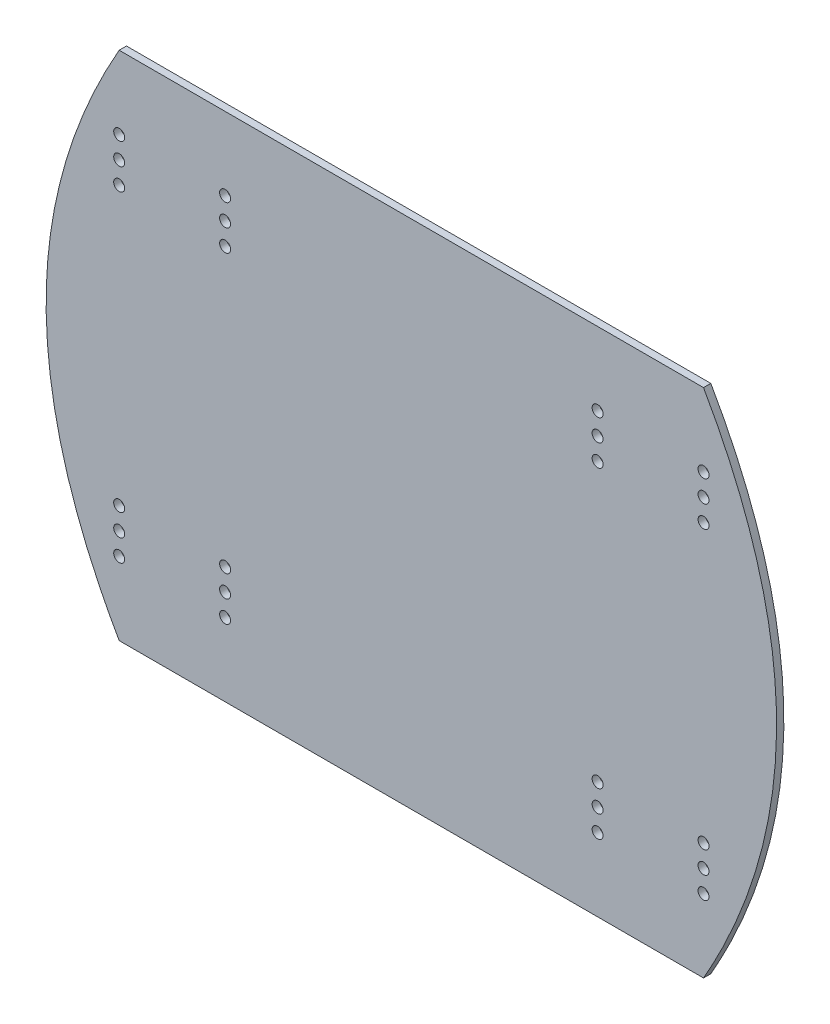
ISO-10303-21;
HEADER;
FILE_DESCRIPTION(('STEP AP214'),'2;1');
FILE_NAME('part.step','',(''),(''),'','','');
FILE_SCHEMA(('AUTOMOTIVE_DESIGN { 1 0 10303 214 1 1 1 1 }'));
ENDSEC;
DATA;
#1=APPLICATION_CONTEXT('core data for automotive mechanical design processes');
#2=APPLICATION_PROTOCOL_DEFINITION('international standard','automotive_design',2000,#1);
#3=PRODUCT_CONTEXT('',#1,'mechanical');
#4=PRODUCT('Part','Part','',(#3));
#5=PRODUCT_RELATED_PRODUCT_CATEGORY('part','',(#4));
#6=PRODUCT_DEFINITION_FORMATION('','',#4);
#7=PRODUCT_DEFINITION_CONTEXT('part definition',#1,'design');
#8=PRODUCT_DEFINITION('design','',#6,#7);
#9=PRODUCT_DEFINITION_SHAPE('','',#8);
#10=(LENGTH_UNIT() NAMED_UNIT(*) SI_UNIT(.MILLI.,.METRE.));
#11=(NAMED_UNIT(*) PLANE_ANGLE_UNIT() SI_UNIT($,.RADIAN.));
#12=(NAMED_UNIT(*) SI_UNIT($,.STERADIAN.) SOLID_ANGLE_UNIT());
#13=UNCERTAINTY_MEASURE_WITH_UNIT(LENGTH_MEASURE(1.E-05),#10,'distance_accuracy_value','');
#14=(GEOMETRIC_REPRESENTATION_CONTEXT(3) GLOBAL_UNCERTAINTY_ASSIGNED_CONTEXT((#13)) GLOBAL_UNIT_ASSIGNED_CONTEXT((#10,
#11,#12)) REPRESENTATION_CONTEXT('',''));
#15=CARTESIAN_POINT('',(0.,0.,0.));
#16=DIRECTION('',(0.,0.,1.));
#17=DIRECTION('',(1.,0.,0.));
#18=AXIS2_PLACEMENT_3D('',#15,#16,#17);
#19=CARTESIAN_POINT('',(80.,70.,307.174130620536));
#20=CARTESIAN_POINT('',(120.,0.,307.174130620536));
#21=CARTESIAN_POINT('',(79.9999999999999,-70.,307.174130620536));
#22=B_SPLINE_CURVE_WITH_KNOTS('',2,(#19,#20,#21),.UNSPECIFIED.,.F.,.F.,(3,3),(0.,1.),.UNSPECIFIED.);
#23=DIRECTION('',(0.,0.,-1.));
#24=VECTOR('',#23,1.);
#25=SURFACE_OF_LINEAR_EXTRUSION('',#22,#24);
#26=DIRECTION('',(0.,0.,-1.));
#27=VECTOR('',#26,1.);
#28=CARTESIAN_POINT('',(80.,70.,307.174130620536));
#29=LINE('',#28,#27);
#30=CARTESIAN_POINT('',(80.,70.,2.));
#31=VERTEX_POINT('',#30);
#32=CARTESIAN_POINT('',(80.,70.,0.));
#33=VERTEX_POINT('',#32);
#34=EDGE_CURVE('E92',#31,#33,#29,.T.);
#35=ORIENTED_EDGE('',*,*,#34,.F.);
#36=CARTESIAN_POINT('',(80.,70.,2.));
#37=CARTESIAN_POINT('',(120.,0.,2.));
#38=CARTESIAN_POINT('',(79.9999999999999,-70.,2.));
#39=B_SPLINE_CURVE_WITH_KNOTS('',2,(#36,#37,#38),.UNSPECIFIED.,.F.,.F.,(3,3),(0.,1.),.UNSPECIFIED.);
#40=CARTESIAN_POINT('',(79.9999999999999,-70.,2.));
#41=VERTEX_POINT('',#40);
#42=EDGE_CURVE('E54',#41,#31,#39,.F.);
#43=ORIENTED_EDGE('',*,*,#42,.F.);
#44=DIRECTION('',(0.,0.,-1.));
#45=VECTOR('',#44,1.);
#46=CARTESIAN_POINT('',(79.9999999999999,-70.,307.174130620536));
#47=LINE('',#46,#45);
#48=CARTESIAN_POINT('',(79.9999999999999,-70.,0.));
#49=VERTEX_POINT('',#48);
#50=EDGE_CURVE('E62',#41,#49,#47,.T.);
#51=ORIENTED_EDGE('',*,*,#50,.T.);
#52=CARTESIAN_POINT('',(80.,70.,0.));
#53=CARTESIAN_POINT('',(120.,0.,0.));
#54=CARTESIAN_POINT('',(79.9999999999999,-70.,0.));
#55=B_SPLINE_CURVE_WITH_KNOTS('',2,(#52,#53,#54),.UNSPECIFIED.,.F.,.F.,(3,3),(0.,1.),.UNSPECIFIED.);
#56=EDGE_CURVE('E11',#49,#33,#55,.F.);
#57=ORIENTED_EDGE('',*,*,#56,.T.);
#58=EDGE_LOOP('',(#35,#43,#51,#57));
#59=FACE_BOUND('',#58,.T.);
#60=ADVANCED_FACE('F37',(#59),#25,.T.);
#61=CARTESIAN_POINT('',(100.,-70.,2.));
#62=DIRECTION('',(0.,1.,0.));
#63=DIRECTION('',(-1.,0.,0.));
#64=AXIS2_PLACEMENT_3D('',#61,#62,#63);
#65=PLANE('',#64);
#66=ORIENTED_EDGE('',*,*,#50,.F.);
#67=DIRECTION('',(1.,0.,0.));
#68=VECTOR('',#67,1.);
#69=CARTESIAN_POINT('',(100.,-70.,2.));
#70=LINE('',#69,#68);
#71=CARTESIAN_POINT('',(-80.,-70.,2.));
#72=VERTEX_POINT('',#71);
#73=EDGE_CURVE('E88',#72,#41,#70,.T.);
#74=ORIENTED_EDGE('',*,*,#73,.F.);
#75=DIRECTION('',(0.,0.,-1.));
#76=VECTOR('',#75,1.);
#77=CARTESIAN_POINT('',(-80.,-70.,309.674130620536));
#78=LINE('',#77,#76);
#79=CARTESIAN_POINT('',(-80.,-70.,0.));
#80=VERTEX_POINT('',#79);
#81=EDGE_CURVE('E114',#72,#80,#78,.T.);
#82=ORIENTED_EDGE('',*,*,#81,.T.);
#83=DIRECTION('',(1.,0.,0.));
#84=VECTOR('',#83,1.);
#85=CARTESIAN_POINT('',(100.,-70.,0.));
#86=LINE('',#85,#84);
#87=EDGE_CURVE('E89',#80,#49,#86,.T.);
#88=ORIENTED_EDGE('',*,*,#87,.T.);
#89=EDGE_LOOP('',(#66,#74,#82,#88));
#90=FACE_BOUND('',#89,.T.);
#91=ADVANCED_FACE('F39',(#90),#65,.F.);
#92=CARTESIAN_POINT('',(0.,0.,2.));
#93=DIRECTION('',(0.,0.,1.));
#94=DIRECTION('',(1.,0.,0.));
#95=AXIS2_PLACEMENT_3D('',#92,#93,#94);
#96=PLANE('',#95);
#97=CARTESIAN_POINT('',(51.,50.0019196147698,2.));
#98=DIRECTION('',(0.,0.,1.));
#99=DIRECTION('',(1.,0.,0.));
#100=AXIS2_PLACEMENT_3D('',#97,#98,#99);
#101=CIRCLE('',#100,1.5);
#102=CARTESIAN_POINT('',(52.5,50.0019196147698,2.));
#103=VERTEX_POINT('',#102);
#104=EDGE_CURVE('E554',#103,#103,#101,.T.);
#105=ORIENTED_EDGE('',*,*,#104,.F.);
#106=EDGE_LOOP('',(#105));
#107=FACE_BOUND('',#106,.T.);
#108=CARTESIAN_POINT('',(51.,44.0019196147698,2.));
#109=DIRECTION('',(0.,0.,1.));
#110=DIRECTION('',(1.,0.,0.));
#111=AXIS2_PLACEMENT_3D('',#108,#109,#110);
#112=CIRCLE('',#111,1.5);
#113=CARTESIAN_POINT('',(52.5,44.0019196147698,2.));
#114=VERTEX_POINT('',#113);
#115=EDGE_CURVE('E558',#114,#114,#112,.T.);
#116=ORIENTED_EDGE('',*,*,#115,.F.);
#117=EDGE_LOOP('',(#116));
#118=FACE_BOUND('',#117,.T.);
#119=CARTESIAN_POINT('',(51.,38.0019196147698,2.));
#120=DIRECTION('',(0.,0.,1.));
#121=DIRECTION('',(1.,0.,0.));
#122=AXIS2_PLACEMENT_3D('',#119,#120,#121);
#123=CIRCLE('',#122,1.5);
#124=CARTESIAN_POINT('',(52.5,38.0019196147698,2.));
#125=VERTEX_POINT('',#124);
#126=EDGE_CURVE('E562',#125,#125,#123,.T.);
#127=ORIENTED_EDGE('',*,*,#126,.F.);
#128=EDGE_LOOP('',(#127));
#129=FACE_BOUND('',#128,.T.);
#130=CARTESIAN_POINT('',(51.,-38.,2.));
#131=DIRECTION('',(0.,0.,1.));
#132=DIRECTION('',(1.,0.,0.));
#133=AXIS2_PLACEMENT_3D('',#130,#131,#132);
#134=CIRCLE('',#133,1.5);
#135=CARTESIAN_POINT('',(52.5,-38.,2.));
#136=VERTEX_POINT('',#135);
#137=EDGE_CURVE('E537',#136,#136,#134,.T.);
#138=ORIENTED_EDGE('',*,*,#137,.F.);
#139=EDGE_LOOP('',(#138));
#140=FACE_BOUND('',#139,.T.);
#141=CARTESIAN_POINT('',(51.,-44.0000000000001,2.));
#142=DIRECTION('',(0.,0.,1.));
#143=DIRECTION('',(1.,0.,0.));
#144=AXIS2_PLACEMENT_3D('',#141,#142,#143);
#145=CIRCLE('',#144,1.5);
#146=CARTESIAN_POINT('',(52.5,-44.0000000000001,2.));
#147=VERTEX_POINT('',#146);
#148=EDGE_CURVE('E538',#147,#147,#145,.T.);
#149=ORIENTED_EDGE('',*,*,#148,.F.);
#150=EDGE_LOOP('',(#149));
#151=FACE_BOUND('',#150,.T.);
#152=CARTESIAN_POINT('',(51.,-50.0000000000001,2.));
#153=DIRECTION('',(0.,0.,1.));
#154=DIRECTION('',(1.,0.,0.));
#155=AXIS2_PLACEMENT_3D('',#152,#153,#154);
#156=CIRCLE('',#155,1.5);
#157=CARTESIAN_POINT('',(52.5,-50.0000000000001,2.));
#158=VERTEX_POINT('',#157);
#159=EDGE_CURVE('E542',#158,#158,#156,.T.);
#160=ORIENTED_EDGE('',*,*,#159,.F.);
#161=EDGE_LOOP('',(#160));
#162=FACE_BOUND('',#161,.T.);
#163=CARTESIAN_POINT('',(80.,-38.,2.));
#164=DIRECTION('',(0.,0.,1.));
#165=DIRECTION('',(1.,0.,0.));
#166=AXIS2_PLACEMENT_3D('',#163,#164,#165);
#167=CIRCLE('',#166,1.5);
#168=CARTESIAN_POINT('',(81.5,-38.,2.));
#169=VERTEX_POINT('',#168);
#170=EDGE_CURVE('E546',#169,#169,#167,.T.);
#171=ORIENTED_EDGE('',*,*,#170,.F.);
#172=EDGE_LOOP('',(#171));
#173=FACE_BOUND('',#172,.T.);
#174=CARTESIAN_POINT('',(80.,-44.,2.));
#175=DIRECTION('',(0.,0.,1.));
#176=DIRECTION('',(1.,0.,0.));
#177=AXIS2_PLACEMENT_3D('',#174,#175,#176);
#178=CIRCLE('',#177,1.5);
#179=CARTESIAN_POINT('',(81.5,-44.,2.));
#180=VERTEX_POINT('',#179);
#181=EDGE_CURVE('E533',#180,#180,#178,.T.);
#182=ORIENTED_EDGE('',*,*,#181,.F.);
#183=EDGE_LOOP('',(#182));
#184=FACE_BOUND('',#183,.T.);
#185=CARTESIAN_POINT('',(-80.,44.0019196147698,2.));
#186=DIRECTION('',(0.,0.,1.));
#187=DIRECTION('',(1.,0.,0.));
#188=AXIS2_PLACEMENT_3D('',#185,#186,#187);
#189=CIRCLE('',#188,1.5);
#190=CARTESIAN_POINT('',(-78.5,44.0019196147698,2.));
#191=VERTEX_POINT('',#190);
#192=EDGE_CURVE('E586',#191,#191,#189,.T.);
#193=ORIENTED_EDGE('',*,*,#192,.F.);
#194=EDGE_LOOP('',(#193));
#195=FACE_BOUND('',#194,.T.);
#196=CARTESIAN_POINT('',(-80.,38.0019196147698,2.));
#197=DIRECTION('',(0.,0.,1.));
#198=DIRECTION('',(1.,0.,0.));
#199=AXIS2_PLACEMENT_3D('',#196,#197,#198);
#200=CIRCLE('',#199,1.5);
#201=CARTESIAN_POINT('',(-78.5,38.0019196147698,2.));
#202=VERTEX_POINT('',#201);
#203=EDGE_CURVE('E590',#202,#202,#200,.T.);
#204=ORIENTED_EDGE('',*,*,#203,.F.);
#205=EDGE_LOOP('',(#204));
#206=FACE_BOUND('',#205,.T.);
#207=CARTESIAN_POINT('',(-51.,50.0019196147698,2.));
#208=DIRECTION('',(0.,0.,1.));
#209=DIRECTION('',(1.,0.,0.));
#210=AXIS2_PLACEMENT_3D('',#207,#208,#209);
#211=CIRCLE('',#210,1.5);
#212=CARTESIAN_POINT('',(-49.5,50.0019196147698,2.));
#213=VERTEX_POINT('',#212);
#214=EDGE_CURVE('E594',#213,#213,#211,.T.);
#215=ORIENTED_EDGE('',*,*,#214,.F.);
#216=EDGE_LOOP('',(#215));
#217=FACE_BOUND('',#216,.T.);
#218=CARTESIAN_POINT('',(-51.,44.0019196147698,2.));
#219=DIRECTION('',(0.,0.,1.));
#220=DIRECTION('',(1.,0.,0.));
#221=AXIS2_PLACEMENT_3D('',#218,#219,#220);
#222=CIRCLE('',#221,1.5);
#223=CARTESIAN_POINT('',(-49.5,44.0019196147698,2.));
#224=VERTEX_POINT('',#223);
#225=EDGE_CURVE('E577',#224,#224,#222,.T.);
#226=ORIENTED_EDGE('',*,*,#225,.F.);
#227=EDGE_LOOP('',(#226));
#228=FACE_BOUND('',#227,.T.);
#229=CARTESIAN_POINT('',(80.,38.0019196147698,2.));
#230=DIRECTION('',(0.,0.,1.));
#231=DIRECTION('',(1.,0.,0.));
#232=AXIS2_PLACEMENT_3D('',#229,#230,#231);
#233=CIRCLE('',#232,1.5);
#234=CARTESIAN_POINT('',(81.5,38.0019196147698,2.));
#235=VERTEX_POINT('',#234);
#236=EDGE_CURVE('E553',#235,#235,#233,.T.);
#237=ORIENTED_EDGE('',*,*,#236,.F.);
#238=EDGE_LOOP('',(#237));
#239=FACE_BOUND('',#238,.T.);
#240=CARTESIAN_POINT('',(80.,44.0019196147698,2.));
#241=DIRECTION('',(0.,0.,1.));
#242=DIRECTION('',(1.,0.,0.));
#243=AXIS2_PLACEMENT_3D('',#240,#241,#242);
#244=CIRCLE('',#243,1.5);
#245=CARTESIAN_POINT('',(81.5,44.0019196147698,2.));
#246=VERTEX_POINT('',#245);
#247=EDGE_CURVE('E570',#246,#246,#244,.T.);
#248=ORIENTED_EDGE('',*,*,#247,.F.);
#249=EDGE_LOOP('',(#248));
#250=FACE_BOUND('',#249,.T.);
#251=CARTESIAN_POINT('',(80.,50.0019196147698,2.));
#252=DIRECTION('',(0.,0.,1.));
#253=DIRECTION('',(1.,0.,0.));
#254=AXIS2_PLACEMENT_3D('',#251,#252,#253);
#255=CIRCLE('',#254,1.5);
#256=CARTESIAN_POINT('',(81.5,50.0019196147698,2.));
#257=VERTEX_POINT('',#256);
#258=EDGE_CURVE('E569',#257,#257,#255,.T.);
#259=ORIENTED_EDGE('',*,*,#258,.F.);
#260=EDGE_LOOP('',(#259));
#261=FACE_BOUND('',#260,.T.);
#262=CARTESIAN_POINT('',(-51.,38.0019196147698,2.));
#263=DIRECTION('',(0.,0.,1.));
#264=DIRECTION('',(1.,0.,0.));
#265=AXIS2_PLACEMENT_3D('',#262,#263,#264);
#266=CIRCLE('',#265,1.5);
#267=CARTESIAN_POINT('',(-49.5,38.0019196147698,2.));
#268=VERTEX_POINT('',#267);
#269=EDGE_CURVE('E578',#268,#268,#266,.T.);
#270=ORIENTED_EDGE('',*,*,#269,.F.);
#271=EDGE_LOOP('',(#270));
#272=FACE_BOUND('',#271,.T.);
#273=CARTESIAN_POINT('',(80.,-50.,2.));
#274=DIRECTION('',(0.,0.,1.));
#275=DIRECTION('',(1.,0.,0.));
#276=AXIS2_PLACEMENT_3D('',#273,#274,#275);
#277=CIRCLE('',#276,1.5);
#278=CARTESIAN_POINT('',(81.5,-50.,2.));
#279=VERTEX_POINT('',#278);
#280=EDGE_CURVE('E524',#279,#279,#277,.T.);
#281=ORIENTED_EDGE('',*,*,#280,.F.);
#282=EDGE_LOOP('',(#281));
#283=FACE_BOUND('',#282,.T.);
#284=CARTESIAN_POINT('',(-80.,50.0019196147698,2.));
#285=DIRECTION('',(0.,0.,1.));
#286=DIRECTION('',(1.,0.,0.));
#287=AXIS2_PLACEMENT_3D('',#284,#285,#286);
#288=CIRCLE('',#287,1.5);
#289=CARTESIAN_POINT('',(-78.5,50.0019196147698,2.));
#290=VERTEX_POINT('',#289);
#291=EDGE_CURVE('E585',#290,#290,#288,.T.);
#292=ORIENTED_EDGE('',*,*,#291,.F.);
#293=EDGE_LOOP('',(#292));
#294=FACE_BOUND('',#293,.T.);
#295=CARTESIAN_POINT('',(-80.,-50.,2.));
#296=DIRECTION('',(0.,0.,1.));
#297=DIRECTION('',(1.,0.,0.));
#298=AXIS2_PLACEMENT_3D('',#295,#296,#297);
#299=CIRCLE('',#298,1.5);
#300=CARTESIAN_POINT('',(-78.5,-50.,2.));
#301=VERTEX_POINT('',#300);
#302=EDGE_CURVE('E608',#301,#301,#299,.T.);
#303=ORIENTED_EDGE('',*,*,#302,.F.);
#304=EDGE_LOOP('',(#303));
#305=FACE_BOUND('',#304,.T.);
#306=CARTESIAN_POINT('',(-80.,-38.,2.));
#307=DIRECTION('',(0.,0.,1.));
#308=DIRECTION('',(1.,0.,0.));
#309=AXIS2_PLACEMENT_3D('',#306,#307,#308);
#310=CIRCLE('',#309,1.5);
#311=CARTESIAN_POINT('',(-78.5,-38.,2.));
#312=VERTEX_POINT('',#311);
#313=EDGE_CURVE('E612',#312,#312,#310,.T.);
#314=ORIENTED_EDGE('',*,*,#313,.F.);
#315=EDGE_LOOP('',(#314));
#316=FACE_BOUND('',#315,.T.);
#317=CARTESIAN_POINT('',(-51.,-50.,2.));
#318=DIRECTION('',(0.,0.,1.));
#319=DIRECTION('',(1.,0.,0.));
#320=AXIS2_PLACEMENT_3D('',#317,#318,#319);
#321=CIRCLE('',#320,1.5);
#322=CARTESIAN_POINT('',(-49.5,-50.,2.));
#323=VERTEX_POINT('',#322);
#324=EDGE_CURVE('E616',#323,#323,#321,.T.);
#325=ORIENTED_EDGE('',*,*,#324,.F.);
#326=EDGE_LOOP('',(#325));
#327=FACE_BOUND('',#326,.T.);
#328=CARTESIAN_POINT('',(-51.,-38.,2.));
#329=DIRECTION('',(0.,0.,1.));
#330=DIRECTION('',(1.,0.,0.));
#331=AXIS2_PLACEMENT_3D('',#328,#329,#330);
#332=CIRCLE('',#331,1.5);
#333=CARTESIAN_POINT('',(-49.5,-38.,2.));
#334=VERTEX_POINT('',#333);
#335=EDGE_CURVE('E511',#334,#334,#332,.T.);
#336=ORIENTED_EDGE('',*,*,#335,.F.);
#337=EDGE_LOOP('',(#336));
#338=FACE_BOUND('',#337,.T.);
#339=CARTESIAN_POINT('',(-51.,-44.,2.));
#340=DIRECTION('',(0.,0.,1.));
#341=DIRECTION('',(1.,0.,0.));
#342=AXIS2_PLACEMENT_3D('',#339,#340,#341);
#343=CIRCLE('',#342,1.5);
#344=CARTESIAN_POINT('',(-49.5,-44.,2.));
#345=VERTEX_POINT('',#344);
#346=EDGE_CURVE('E601',#345,#345,#343,.T.);
#347=ORIENTED_EDGE('',*,*,#346,.F.);
#348=EDGE_LOOP('',(#347));
#349=FACE_BOUND('',#348,.T.);
#350=CARTESIAN_POINT('',(-80.,-44.,2.));
#351=DIRECTION('',(0.,0.,1.));
#352=DIRECTION('',(1.,0.,0.));
#353=AXIS2_PLACEMENT_3D('',#350,#351,#352);
#354=CIRCLE('',#353,1.5);
#355=CARTESIAN_POINT('',(-78.5,-44.,2.));
#356=VERTEX_POINT('',#355);
#357=EDGE_CURVE('E505',#356,#356,#354,.T.);
#358=ORIENTED_EDGE('',*,*,#357,.F.);
#359=EDGE_LOOP('',(#358));
#360=FACE_BOUND('',#359,.T.);
#361=ORIENTED_EDGE('',*,*,#73,.T.);
#362=ORIENTED_EDGE('',*,*,#42,.T.);
#363=DIRECTION('',(-1.,0.,0.));
#364=VECTOR('',#363,1.);
#365=CARTESIAN_POINT('',(100.,70.,2.));
#366=LINE('',#365,#364);
#367=CARTESIAN_POINT('',(-80.,70.,2.));
#368=VERTEX_POINT('',#367);
#369=EDGE_CURVE('E94',#31,#368,#366,.T.);
#370=ORIENTED_EDGE('',*,*,#369,.T.);
#371=CARTESIAN_POINT('',(-80.,70.,2.));
#372=CARTESIAN_POINT('',(-120.,0.,2.));
#373=CARTESIAN_POINT('',(-80.,-70.,2.));
#374=B_SPLINE_CURVE_WITH_KNOTS('',2,(#371,#372,#373),.UNSPECIFIED.,.F.,.F.,(3,3),(0.,1.),.UNSPECIFIED.);
#375=EDGE_CURVE('E521',#72,#368,#374,.F.);
#376=ORIENTED_EDGE('',*,*,#375,.F.);
#377=EDGE_LOOP('',(#361,#362,#370,#376));
#378=FACE_BOUND('',#377,.T.);
#379=ADVANCED_FACE('F221',(#107,#118,#129,#140,#151,#162,#173,#184,#195,#206,#217,#228,#239,
#250,#261,#272,#283,#294,#305,#316,#327,#338,#349,#360,#378),#96,.T.);
#380=CARTESIAN_POINT('',(0.,0.,0.));
#381=DIRECTION('',(0.,0.,1.));
#382=DIRECTION('',(1.,0.,0.));
#383=AXIS2_PLACEMENT_3D('',#380,#381,#382);
#384=PLANE('',#383);
#385=CARTESIAN_POINT('',(51.,50.0019196147698,0.));
#386=DIRECTION('',(0.,0.,1.));
#387=DIRECTION('',(1.,0.,0.));
#388=AXIS2_PLACEMENT_3D('',#385,#386,#387);
#389=CIRCLE('',#388,1.5);
#390=CARTESIAN_POINT('',(52.5,50.0019196147698,0.));
#391=VERTEX_POINT('',#390);
#392=EDGE_CURVE('E413',#391,#391,#389,.T.);
#393=ORIENTED_EDGE('',*,*,#392,.T.);
#394=EDGE_LOOP('',(#393));
#395=FACE_BOUND('',#394,.T.);
#396=CARTESIAN_POINT('',(51.,44.0019196147698,0.));
#397=DIRECTION('',(0.,0.,1.));
#398=DIRECTION('',(1.,0.,0.));
#399=AXIS2_PLACEMENT_3D('',#396,#397,#398);
#400=CIRCLE('',#399,1.5);
#401=CARTESIAN_POINT('',(52.5,44.0019196147698,0.));
#402=VERTEX_POINT('',#401);
#403=EDGE_CURVE('E417',#402,#402,#400,.T.);
#404=ORIENTED_EDGE('',*,*,#403,.T.);
#405=EDGE_LOOP('',(#404));
#406=FACE_BOUND('',#405,.T.);
#407=CARTESIAN_POINT('',(51.,38.0019196147698,0.));
#408=DIRECTION('',(0.,0.,1.));
#409=DIRECTION('',(1.,0.,0.));
#410=AXIS2_PLACEMENT_3D('',#407,#408,#409);
#411=CIRCLE('',#410,1.5);
#412=CARTESIAN_POINT('',(52.5,38.0019196147698,0.));
#413=VERTEX_POINT('',#412);
#414=EDGE_CURVE('E421',#413,#413,#411,.T.);
#415=ORIENTED_EDGE('',*,*,#414,.T.);
#416=EDGE_LOOP('',(#415));
#417=FACE_BOUND('',#416,.T.);
#418=CARTESIAN_POINT('',(51.,-38.,0.));
#419=DIRECTION('',(0.,0.,1.));
#420=DIRECTION('',(1.,0.,0.));
#421=AXIS2_PLACEMENT_3D('',#418,#419,#420);
#422=CIRCLE('',#421,1.5);
#423=CARTESIAN_POINT('',(52.5,-38.,0.));
#424=VERTEX_POINT('',#423);
#425=EDGE_CURVE('E425',#424,#424,#422,.T.);
#426=ORIENTED_EDGE('',*,*,#425,.T.);
#427=EDGE_LOOP('',(#426));
#428=FACE_BOUND('',#427,.T.);
#429=CARTESIAN_POINT('',(51.,-44.0000000000001,0.));
#430=DIRECTION('',(0.,0.,1.));
#431=DIRECTION('',(1.,0.,0.));
#432=AXIS2_PLACEMENT_3D('',#429,#430,#431);
#433=CIRCLE('',#432,1.5);
#434=CARTESIAN_POINT('',(52.5,-44.0000000000001,0.));
#435=VERTEX_POINT('',#434);
#436=EDGE_CURVE('E429',#435,#435,#433,.T.);
#437=ORIENTED_EDGE('',*,*,#436,.T.);
#438=EDGE_LOOP('',(#437));
#439=FACE_BOUND('',#438,.T.);
#440=CARTESIAN_POINT('',(51.,-50.0000000000001,0.));
#441=DIRECTION('',(0.,0.,1.));
#442=DIRECTION('',(1.,0.,0.));
#443=AXIS2_PLACEMENT_3D('',#440,#441,#442);
#444=CIRCLE('',#443,1.5);
#445=CARTESIAN_POINT('',(52.5,-50.0000000000001,0.));
#446=VERTEX_POINT('',#445);
#447=EDGE_CURVE('E433',#446,#446,#444,.T.);
#448=ORIENTED_EDGE('',*,*,#447,.T.);
#449=EDGE_LOOP('',(#448));
#450=FACE_BOUND('',#449,.T.);
#451=CARTESIAN_POINT('',(80.,-38.,0.));
#452=DIRECTION('',(0.,0.,1.));
#453=DIRECTION('',(1.,0.,0.));
#454=AXIS2_PLACEMENT_3D('',#451,#452,#453);
#455=CIRCLE('',#454,1.5);
#456=CARTESIAN_POINT('',(81.5,-38.,0.));
#457=VERTEX_POINT('',#456);
#458=EDGE_CURVE('E437',#457,#457,#455,.T.);
#459=ORIENTED_EDGE('',*,*,#458,.T.);
#460=EDGE_LOOP('',(#459));
#461=FACE_BOUND('',#460,.T.);
#462=CARTESIAN_POINT('',(80.,-44.,0.));
#463=DIRECTION('',(0.,0.,1.));
#464=DIRECTION('',(1.,0.,0.));
#465=AXIS2_PLACEMENT_3D('',#462,#463,#464);
#466=CIRCLE('',#465,1.5);
#467=CARTESIAN_POINT('',(81.5,-44.,0.));
#468=VERTEX_POINT('',#467);
#469=EDGE_CURVE('E441',#468,#468,#466,.T.);
#470=ORIENTED_EDGE('',*,*,#469,.T.);
#471=EDGE_LOOP('',(#470));
#472=FACE_BOUND('',#471,.T.);
#473=CARTESIAN_POINT('',(-80.,44.0019196147698,0.));
#474=DIRECTION('',(0.,0.,1.));
#475=DIRECTION('',(1.,0.,0.));
#476=AXIS2_PLACEMENT_3D('',#473,#474,#475);
#477=CIRCLE('',#476,1.5);
#478=CARTESIAN_POINT('',(-78.5,44.0019196147698,0.));
#479=VERTEX_POINT('',#478);
#480=EDGE_CURVE('E445',#479,#479,#477,.T.);
#481=ORIENTED_EDGE('',*,*,#480,.T.);
#482=EDGE_LOOP('',(#481));
#483=FACE_BOUND('',#482,.T.);
#484=CARTESIAN_POINT('',(-80.,38.0019196147698,0.));
#485=DIRECTION('',(0.,0.,1.));
#486=DIRECTION('',(1.,0.,0.));
#487=AXIS2_PLACEMENT_3D('',#484,#485,#486);
#488=CIRCLE('',#487,1.5);
#489=CARTESIAN_POINT('',(-78.5,38.0019196147698,0.));
#490=VERTEX_POINT('',#489);
#491=EDGE_CURVE('E449',#490,#490,#488,.T.);
#492=ORIENTED_EDGE('',*,*,#491,.T.);
#493=EDGE_LOOP('',(#492));
#494=FACE_BOUND('',#493,.T.);
#495=CARTESIAN_POINT('',(-51.,50.0019196147698,0.));
#496=DIRECTION('',(0.,0.,1.));
#497=DIRECTION('',(1.,0.,0.));
#498=AXIS2_PLACEMENT_3D('',#495,#496,#497);
#499=CIRCLE('',#498,1.5);
#500=CARTESIAN_POINT('',(-49.5,50.0019196147698,0.));
#501=VERTEX_POINT('',#500);
#502=EDGE_CURVE('E453',#501,#501,#499,.T.);
#503=ORIENTED_EDGE('',*,*,#502,.T.);
#504=EDGE_LOOP('',(#503));
#505=FACE_BOUND('',#504,.T.);
#506=CARTESIAN_POINT('',(-51.,44.0019196147698,0.));
#507=DIRECTION('',(0.,0.,1.));
#508=DIRECTION('',(1.,0.,0.));
#509=AXIS2_PLACEMENT_3D('',#506,#507,#508);
#510=CIRCLE('',#509,1.5);
#511=CARTESIAN_POINT('',(-49.5,44.0019196147698,0.));
#512=VERTEX_POINT('',#511);
#513=EDGE_CURVE('E457',#512,#512,#510,.T.);
#514=ORIENTED_EDGE('',*,*,#513,.T.);
#515=EDGE_LOOP('',(#514));
#516=FACE_BOUND('',#515,.T.);
#517=CARTESIAN_POINT('',(80.,38.0019196147698,0.));
#518=DIRECTION('',(0.,0.,1.));
#519=DIRECTION('',(1.,0.,0.));
#520=AXIS2_PLACEMENT_3D('',#517,#518,#519);
#521=CIRCLE('',#520,1.5);
#522=CARTESIAN_POINT('',(81.5,38.0019196147698,0.));
#523=VERTEX_POINT('',#522);
#524=EDGE_CURVE('E461',#523,#523,#521,.T.);
#525=ORIENTED_EDGE('',*,*,#524,.T.);
#526=EDGE_LOOP('',(#525));
#527=FACE_BOUND('',#526,.T.);
#528=CARTESIAN_POINT('',(80.,44.0019196147698,0.));
#529=DIRECTION('',(0.,0.,1.));
#530=DIRECTION('',(1.,0.,0.));
#531=AXIS2_PLACEMENT_3D('',#528,#529,#530);
#532=CIRCLE('',#531,1.5);
#533=CARTESIAN_POINT('',(81.5,44.0019196147698,0.));
#534=VERTEX_POINT('',#533);
#535=EDGE_CURVE('E465',#534,#534,#532,.T.);
#536=ORIENTED_EDGE('',*,*,#535,.T.);
#537=EDGE_LOOP('',(#536));
#538=FACE_BOUND('',#537,.T.);
#539=CARTESIAN_POINT('',(80.,50.0019196147698,0.));
#540=DIRECTION('',(0.,0.,1.));
#541=DIRECTION('',(1.,0.,0.));
#542=AXIS2_PLACEMENT_3D('',#539,#540,#541);
#543=CIRCLE('',#542,1.5);
#544=CARTESIAN_POINT('',(81.5,50.0019196147698,0.));
#545=VERTEX_POINT('',#544);
#546=EDGE_CURVE('E469',#545,#545,#543,.T.);
#547=ORIENTED_EDGE('',*,*,#546,.T.);
#548=EDGE_LOOP('',(#547));
#549=FACE_BOUND('',#548,.T.);
#550=CARTESIAN_POINT('',(-51.,38.0019196147698,0.));
#551=DIRECTION('',(0.,0.,1.));
#552=DIRECTION('',(1.,0.,0.));
#553=AXIS2_PLACEMENT_3D('',#550,#551,#552);
#554=CIRCLE('',#553,1.5);
#555=CARTESIAN_POINT('',(-49.5,38.0019196147698,0.));
#556=VERTEX_POINT('',#555);
#557=EDGE_CURVE('E473',#556,#556,#554,.T.);
#558=ORIENTED_EDGE('',*,*,#557,.T.);
#559=EDGE_LOOP('',(#558));
#560=FACE_BOUND('',#559,.T.);
#561=CARTESIAN_POINT('',(80.,-50.,0.));
#562=DIRECTION('',(0.,0.,1.));
#563=DIRECTION('',(1.,0.,0.));
#564=AXIS2_PLACEMENT_3D('',#561,#562,#563);
#565=CIRCLE('',#564,1.5);
#566=CARTESIAN_POINT('',(81.5,-50.,0.));
#567=VERTEX_POINT('',#566);
#568=EDGE_CURVE('E477',#567,#567,#565,.T.);
#569=ORIENTED_EDGE('',*,*,#568,.T.);
#570=EDGE_LOOP('',(#569));
#571=FACE_BOUND('',#570,.T.);
#572=CARTESIAN_POINT('',(-80.,50.0019196147698,0.));
#573=DIRECTION('',(0.,0.,1.));
#574=DIRECTION('',(1.,0.,0.));
#575=AXIS2_PLACEMENT_3D('',#572,#573,#574);
#576=CIRCLE('',#575,1.5);
#577=CARTESIAN_POINT('',(-78.5,50.0019196147698,0.));
#578=VERTEX_POINT('',#577);
#579=EDGE_CURVE('E481',#578,#578,#576,.T.);
#580=ORIENTED_EDGE('',*,*,#579,.T.);
#581=EDGE_LOOP('',(#580));
#582=FACE_BOUND('',#581,.T.);
#583=CARTESIAN_POINT('',(-80.,-50.,0.));
#584=DIRECTION('',(0.,0.,1.));
#585=DIRECTION('',(1.,0.,0.));
#586=AXIS2_PLACEMENT_3D('',#583,#584,#585);
#587=CIRCLE('',#586,1.5);
#588=CARTESIAN_POINT('',(-78.5,-50.,0.));
#589=VERTEX_POINT('',#588);
#590=EDGE_CURVE('E485',#589,#589,#587,.T.);
#591=ORIENTED_EDGE('',*,*,#590,.T.);
#592=EDGE_LOOP('',(#591));
#593=FACE_BOUND('',#592,.T.);
#594=CARTESIAN_POINT('',(-80.,-38.,0.));
#595=DIRECTION('',(0.,0.,1.));
#596=DIRECTION('',(1.,0.,0.));
#597=AXIS2_PLACEMENT_3D('',#594,#595,#596);
#598=CIRCLE('',#597,1.5);
#599=CARTESIAN_POINT('',(-78.5,-38.,0.));
#600=VERTEX_POINT('',#599);
#601=EDGE_CURVE('E489',#600,#600,#598,.T.);
#602=ORIENTED_EDGE('',*,*,#601,.T.);
#603=EDGE_LOOP('',(#602));
#604=FACE_BOUND('',#603,.T.);
#605=CARTESIAN_POINT('',(-51.,-50.,0.));
#606=DIRECTION('',(0.,0.,1.));
#607=DIRECTION('',(1.,0.,0.));
#608=AXIS2_PLACEMENT_3D('',#605,#606,#607);
#609=CIRCLE('',#608,1.5);
#610=CARTESIAN_POINT('',(-49.5,-50.,0.));
#611=VERTEX_POINT('',#610);
#612=EDGE_CURVE('E493',#611,#611,#609,.T.);
#613=ORIENTED_EDGE('',*,*,#612,.T.);
#614=EDGE_LOOP('',(#613));
#615=FACE_BOUND('',#614,.T.);
#616=CARTESIAN_POINT('',(-51.,-38.,0.));
#617=DIRECTION('',(0.,0.,1.));
#618=DIRECTION('',(1.,0.,0.));
#619=AXIS2_PLACEMENT_3D('',#616,#617,#618);
#620=CIRCLE('',#619,1.5);
#621=CARTESIAN_POINT('',(-49.5,-38.,0.));
#622=VERTEX_POINT('',#621);
#623=EDGE_CURVE('E497',#622,#622,#620,.T.);
#624=ORIENTED_EDGE('',*,*,#623,.T.);
#625=EDGE_LOOP('',(#624));
#626=FACE_BOUND('',#625,.T.);
#627=CARTESIAN_POINT('',(-51.,-44.,0.));
#628=DIRECTION('',(0.,0.,1.));
#629=DIRECTION('',(1.,0.,0.));
#630=AXIS2_PLACEMENT_3D('',#627,#628,#629);
#631=CIRCLE('',#630,1.5);
#632=CARTESIAN_POINT('',(-49.5,-44.,0.));
#633=VERTEX_POINT('',#632);
#634=EDGE_CURVE('E501',#633,#633,#631,.T.);
#635=ORIENTED_EDGE('',*,*,#634,.T.);
#636=EDGE_LOOP('',(#635));
#637=FACE_BOUND('',#636,.T.);
#638=CARTESIAN_POINT('',(-80.,-44.,0.));
#639=DIRECTION('',(0.,0.,1.));
#640=DIRECTION('',(1.,0.,0.));
#641=AXIS2_PLACEMENT_3D('',#638,#639,#640);
#642=CIRCLE('',#641,1.5);
#643=CARTESIAN_POINT('',(-78.5,-44.,0.));
#644=VERTEX_POINT('',#643);
#645=EDGE_CURVE('E504',#644,#644,#642,.T.);
#646=ORIENTED_EDGE('',*,*,#645,.T.);
#647=EDGE_LOOP('',(#646));
#648=FACE_BOUND('',#647,.T.);
#649=ORIENTED_EDGE('',*,*,#56,.F.);
#650=ORIENTED_EDGE('',*,*,#87,.F.);
#651=CARTESIAN_POINT('',(-80.,70.,0.));
#652=CARTESIAN_POINT('',(-120.,0.,0.));
#653=CARTESIAN_POINT('',(-80.,-70.,0.));
#654=B_SPLINE_CURVE_WITH_KNOTS('',2,(#651,#652,#653),.UNSPECIFIED.,.F.,.F.,(3,3),(0.,1.),.UNSPECIFIED.);
#655=CARTESIAN_POINT('',(-80.,70.,0.));
#656=VERTEX_POINT('',#655);
#657=EDGE_CURVE('E47',#80,#656,#654,.F.);
#658=ORIENTED_EDGE('',*,*,#657,.T.);
#659=DIRECTION('',(-1.,0.,0.));
#660=VECTOR('',#659,1.);
#661=CARTESIAN_POINT('',(100.,70.,0.));
#662=LINE('',#661,#660);
#663=EDGE_CURVE('E81',#33,#656,#662,.T.);
#664=ORIENTED_EDGE('',*,*,#663,.F.);
#665=EDGE_LOOP('',(#649,#650,#658,#664));
#666=FACE_BOUND('',#665,.T.);
#667=ADVANCED_FACE('F83',(#395,#406,#417,#428,#439,#450,#461,#472,#483,#494,#505,#516,#527,#538,
#549,#560,#571,#582,#593,#604,#615,#626,#637,#648,#666),#384,.F.);
#668=CARTESIAN_POINT('',(100.,70.,2.));
#669=DIRECTION('',(0.,-1.,0.));
#670=DIRECTION('',(1.,0.,0.));
#671=AXIS2_PLACEMENT_3D('',#668,#669,#670);
#672=PLANE('',#671);
#673=ORIENTED_EDGE('',*,*,#369,.F.);
#674=ORIENTED_EDGE('',*,*,#34,.T.);
#675=ORIENTED_EDGE('',*,*,#663,.T.);
#676=DIRECTION('',(0.,0.,-1.));
#677=VECTOR('',#676,1.);
#678=CARTESIAN_POINT('',(-80.,70.,309.674130620536));
#679=LINE('',#678,#677);
#680=EDGE_CURVE('E98',#368,#656,#679,.T.);
#681=ORIENTED_EDGE('',*,*,#680,.F.);
#682=EDGE_LOOP('',(#673,#674,#675,#681));
#683=FACE_BOUND('',#682,.T.);
#684=ADVANCED_FACE('F93',(#683),#672,.F.);
#685=CARTESIAN_POINT('',(-80.,-44.,0.));
#686=DIRECTION('',(0.,0.,1.));
#687=DIRECTION('',(1.,0.,0.));
#688=AXIS2_PLACEMENT_3D('',#685,#686,#687);
#689=CYLINDRICAL_SURFACE('',#688,1.5);
#690=ORIENTED_EDGE('',*,*,#645,.F.);
#691=EDGE_LOOP('',(#690));
#692=FACE_BOUND('',#691,.T.);
#693=ORIENTED_EDGE('',*,*,#357,.T.);
#694=EDGE_LOOP('',(#693));
#695=FACE_BOUND('',#694,.T.);
#696=ADVANCED_FACE('F202',(#692,#695),#689,.F.);
#697=CARTESIAN_POINT('',(-51.,-44.,0.));
#698=DIRECTION('',(0.,0.,1.));
#699=DIRECTION('',(1.,0.,0.));
#700=AXIS2_PLACEMENT_3D('',#697,#698,#699);
#701=CYLINDRICAL_SURFACE('',#700,1.5);
#702=ORIENTED_EDGE('',*,*,#634,.F.);
#703=EDGE_LOOP('',(#702));
#704=FACE_BOUND('',#703,.T.);
#705=ORIENTED_EDGE('',*,*,#346,.T.);
#706=EDGE_LOOP('',(#705));
#707=FACE_BOUND('',#706,.T.);
#708=ADVANCED_FACE('F198',(#704,#707),#701,.F.);
#709=CARTESIAN_POINT('',(-51.,-38.,0.));
#710=DIRECTION('',(0.,0.,1.));
#711=DIRECTION('',(1.,0.,0.));
#712=AXIS2_PLACEMENT_3D('',#709,#710,#711);
#713=CYLINDRICAL_SURFACE('',#712,1.5);
#714=ORIENTED_EDGE('',*,*,#623,.F.);
#715=EDGE_LOOP('',(#714));
#716=FACE_BOUND('',#715,.T.);
#717=ORIENTED_EDGE('',*,*,#335,.T.);
#718=EDGE_LOOP('',(#717));
#719=FACE_BOUND('',#718,.T.);
#720=ADVANCED_FACE('F201',(#716,#719),#713,.F.);
#721=CARTESIAN_POINT('',(-51.,-50.,0.));
#722=DIRECTION('',(0.,0.,1.));
#723=DIRECTION('',(1.,0.,0.));
#724=AXIS2_PLACEMENT_3D('',#721,#722,#723);
#725=CYLINDRICAL_SURFACE('',#724,1.5);
#726=ORIENTED_EDGE('',*,*,#612,.F.);
#727=EDGE_LOOP('',(#726));
#728=FACE_BOUND('',#727,.T.);
#729=ORIENTED_EDGE('',*,*,#324,.T.);
#730=EDGE_LOOP('',(#729));
#731=FACE_BOUND('',#730,.T.);
#732=ADVANCED_FACE('F210',(#728,#731),#725,.F.);
#733=CARTESIAN_POINT('',(-80.,-38.,0.));
#734=DIRECTION('',(0.,0.,1.));
#735=DIRECTION('',(1.,0.,0.));
#736=AXIS2_PLACEMENT_3D('',#733,#734,#735);
#737=CYLINDRICAL_SURFACE('',#736,1.5);
#738=ORIENTED_EDGE('',*,*,#601,.F.);
#739=EDGE_LOOP('',(#738));
#740=FACE_BOUND('',#739,.T.);
#741=ORIENTED_EDGE('',*,*,#313,.T.);
#742=EDGE_LOOP('',(#741));
#743=FACE_BOUND('',#742,.T.);
#744=ADVANCED_FACE('F206',(#740,#743),#737,.F.);
#745=CARTESIAN_POINT('',(-80.,-50.,0.));
#746=DIRECTION('',(0.,0.,1.));
#747=DIRECTION('',(1.,0.,0.));
#748=AXIS2_PLACEMENT_3D('',#745,#746,#747);
#749=CYLINDRICAL_SURFACE('',#748,1.5);
#750=ORIENTED_EDGE('',*,*,#590,.F.);
#751=EDGE_LOOP('',(#750));
#752=FACE_BOUND('',#751,.T.);
#753=ORIENTED_EDGE('',*,*,#302,.T.);
#754=EDGE_LOOP('',(#753));
#755=FACE_BOUND('',#754,.T.);
#756=ADVANCED_FACE('F196',(#752,#755),#749,.F.);
#757=CARTESIAN_POINT('',(-80.,50.0019196147698,0.));
#758=DIRECTION('',(0.,0.,1.));
#759=DIRECTION('',(1.,0.,0.));
#760=AXIS2_PLACEMENT_3D('',#757,#758,#759);
#761=CYLINDRICAL_SURFACE('',#760,1.5);
#762=ORIENTED_EDGE('',*,*,#579,.F.);
#763=EDGE_LOOP('',(#762));
#764=FACE_BOUND('',#763,.T.);
#765=ORIENTED_EDGE('',*,*,#291,.T.);
#766=EDGE_LOOP('',(#765));
#767=FACE_BOUND('',#766,.T.);
#768=ADVANCED_FACE('F130',(#764,#767),#761,.F.);
#769=CARTESIAN_POINT('',(80.,-50.,0.));
#770=DIRECTION('',(0.,0.,1.));
#771=DIRECTION('',(1.,0.,0.));
#772=AXIS2_PLACEMENT_3D('',#769,#770,#771);
#773=CYLINDRICAL_SURFACE('',#772,1.5);
#774=ORIENTED_EDGE('',*,*,#568,.F.);
#775=EDGE_LOOP('',(#774));
#776=FACE_BOUND('',#775,.T.);
#777=ORIENTED_EDGE('',*,*,#280,.T.);
#778=EDGE_LOOP('',(#777));
#779=FACE_BOUND('',#778,.T.);
#780=ADVANCED_FACE('F126',(#776,#779),#773,.F.);
#781=CARTESIAN_POINT('',(-51.,38.0019196147698,0.));
#782=DIRECTION('',(0.,0.,1.));
#783=DIRECTION('',(1.,0.,0.));
#784=AXIS2_PLACEMENT_3D('',#781,#782,#783);
#785=CYLINDRICAL_SURFACE('',#784,1.5);
#786=ORIENTED_EDGE('',*,*,#557,.F.);
#787=EDGE_LOOP('',(#786));
#788=FACE_BOUND('',#787,.T.);
#789=ORIENTED_EDGE('',*,*,#269,.T.);
#790=EDGE_LOOP('',(#789));
#791=FACE_BOUND('',#790,.T.);
#792=ADVANCED_FACE('F129',(#788,#791),#785,.F.);
#793=CARTESIAN_POINT('',(80.,50.0019196147698,0.));
#794=DIRECTION('',(0.,0.,1.));
#795=DIRECTION('',(1.,0.,0.));
#796=AXIS2_PLACEMENT_3D('',#793,#794,#795);
#797=CYLINDRICAL_SURFACE('',#796,1.5);
#798=ORIENTED_EDGE('',*,*,#546,.F.);
#799=EDGE_LOOP('',(#798));
#800=FACE_BOUND('',#799,.T.);
#801=ORIENTED_EDGE('',*,*,#258,.T.);
#802=EDGE_LOOP('',(#801));
#803=FACE_BOUND('',#802,.T.);
#804=ADVANCED_FACE('F168',(#800,#803),#797,.F.);
#805=CARTESIAN_POINT('',(80.,44.0019196147698,0.));
#806=DIRECTION('',(0.,0.,1.));
#807=DIRECTION('',(1.,0.,0.));
#808=AXIS2_PLACEMENT_3D('',#805,#806,#807);
#809=CYLINDRICAL_SURFACE('',#808,1.5);
#810=ORIENTED_EDGE('',*,*,#535,.F.);
#811=EDGE_LOOP('',(#810));
#812=FACE_BOUND('',#811,.T.);
#813=ORIENTED_EDGE('',*,*,#247,.T.);
#814=EDGE_LOOP('',(#813));
#815=FACE_BOUND('',#814,.T.);
#816=ADVANCED_FACE('F164',(#812,#815),#809,.F.);
#817=CARTESIAN_POINT('',(80.,38.0019196147698,0.));
#818=DIRECTION('',(0.,0.,1.));
#819=DIRECTION('',(1.,0.,0.));
#820=AXIS2_PLACEMENT_3D('',#817,#818,#819);
#821=CYLINDRICAL_SURFACE('',#820,1.5);
#822=ORIENTED_EDGE('',*,*,#524,.F.);
#823=EDGE_LOOP('',(#822));
#824=FACE_BOUND('',#823,.T.);
#825=ORIENTED_EDGE('',*,*,#236,.T.);
#826=EDGE_LOOP('',(#825));
#827=FACE_BOUND('',#826,.T.);
#828=ADVANCED_FACE('F167',(#824,#827),#821,.F.);
#829=CARTESIAN_POINT('',(-51.,44.0019196147698,0.));
#830=DIRECTION('',(0.,0.,1.));
#831=DIRECTION('',(1.,0.,0.));
#832=AXIS2_PLACEMENT_3D('',#829,#830,#831);
#833=CYLINDRICAL_SURFACE('',#832,1.5);
#834=ORIENTED_EDGE('',*,*,#513,.F.);
#835=EDGE_LOOP('',(#834));
#836=FACE_BOUND('',#835,.T.);
#837=ORIENTED_EDGE('',*,*,#225,.T.);
#838=EDGE_LOOP('',(#837));
#839=FACE_BOUND('',#838,.T.);
#840=ADVANCED_FACE('F172',(#836,#839),#833,.F.);
#841=CARTESIAN_POINT('',(-51.,50.0019196147698,0.));
#842=DIRECTION('',(0.,0.,1.));
#843=DIRECTION('',(1.,0.,0.));
#844=AXIS2_PLACEMENT_3D('',#841,#842,#843);
#845=CYLINDRICAL_SURFACE('',#844,1.5);
#846=ORIENTED_EDGE('',*,*,#502,.F.);
#847=EDGE_LOOP('',(#846));
#848=FACE_BOUND('',#847,.T.);
#849=ORIENTED_EDGE('',*,*,#214,.T.);
#850=EDGE_LOOP('',(#849));
#851=FACE_BOUND('',#850,.T.);
#852=ADVANCED_FACE('F186',(#848,#851),#845,.F.);
#853=CARTESIAN_POINT('',(-80.,38.0019196147698,0.));
#854=DIRECTION('',(0.,0.,1.));
#855=DIRECTION('',(1.,0.,0.));
#856=AXIS2_PLACEMENT_3D('',#853,#854,#855);
#857=CYLINDRICAL_SURFACE('',#856,1.5);
#858=ORIENTED_EDGE('',*,*,#491,.F.);
#859=EDGE_LOOP('',(#858));
#860=FACE_BOUND('',#859,.T.);
#861=ORIENTED_EDGE('',*,*,#203,.T.);
#862=EDGE_LOOP('',(#861));
#863=FACE_BOUND('',#862,.T.);
#864=ADVANCED_FACE('F182',(#860,#863),#857,.F.);
#865=CARTESIAN_POINT('',(-80.,44.0019196147698,0.));
#866=DIRECTION('',(0.,0.,1.));
#867=DIRECTION('',(1.,0.,0.));
#868=AXIS2_PLACEMENT_3D('',#865,#866,#867);
#869=CYLINDRICAL_SURFACE('',#868,1.5);
#870=ORIENTED_EDGE('',*,*,#480,.F.);
#871=EDGE_LOOP('',(#870));
#872=FACE_BOUND('',#871,.T.);
#873=ORIENTED_EDGE('',*,*,#192,.T.);
#874=EDGE_LOOP('',(#873));
#875=FACE_BOUND('',#874,.T.);
#876=ADVANCED_FACE('F148',(#872,#875),#869,.F.);
#877=CARTESIAN_POINT('',(80.,-44.,0.));
#878=DIRECTION('',(0.,0.,1.));
#879=DIRECTION('',(1.,0.,0.));
#880=AXIS2_PLACEMENT_3D('',#877,#878,#879);
#881=CYLINDRICAL_SURFACE('',#880,1.5);
#882=ORIENTED_EDGE('',*,*,#469,.F.);
#883=EDGE_LOOP('',(#882));
#884=FACE_BOUND('',#883,.T.);
#885=ORIENTED_EDGE('',*,*,#181,.T.);
#886=EDGE_LOOP('',(#885));
#887=FACE_BOUND('',#886,.T.);
#888=ADVANCED_FACE('F144',(#884,#887),#881,.F.);
#889=CARTESIAN_POINT('',(80.,-38.,0.));
#890=DIRECTION('',(0.,0.,1.));
#891=DIRECTION('',(1.,0.,0.));
#892=AXIS2_PLACEMENT_3D('',#889,#890,#891);
#893=CYLINDRICAL_SURFACE('',#892,1.5);
#894=ORIENTED_EDGE('',*,*,#458,.F.);
#895=EDGE_LOOP('',(#894));
#896=FACE_BOUND('',#895,.T.);
#897=ORIENTED_EDGE('',*,*,#170,.T.);
#898=EDGE_LOOP('',(#897));
#899=FACE_BOUND('',#898,.T.);
#900=ADVANCED_FACE('F140',(#896,#899),#893,.F.);
#901=CARTESIAN_POINT('',(51.,-50.0000000000001,0.));
#902=DIRECTION('',(0.,0.,1.));
#903=DIRECTION('',(1.,0.,0.));
#904=AXIS2_PLACEMENT_3D('',#901,#902,#903);
#905=CYLINDRICAL_SURFACE('',#904,1.5);
#906=ORIENTED_EDGE('',*,*,#447,.F.);
#907=EDGE_LOOP('',(#906));
#908=FACE_BOUND('',#907,.T.);
#909=ORIENTED_EDGE('',*,*,#159,.T.);
#910=EDGE_LOOP('',(#909));
#911=FACE_BOUND('',#910,.T.);
#912=ADVANCED_FACE('F136',(#908,#911),#905,.F.);
#913=CARTESIAN_POINT('',(51.,-44.0000000000001,0.));
#914=DIRECTION('',(0.,0.,1.));
#915=DIRECTION('',(1.,0.,0.));
#916=AXIS2_PLACEMENT_3D('',#913,#914,#915);
#917=CYLINDRICAL_SURFACE('',#916,1.5);
#918=ORIENTED_EDGE('',*,*,#436,.F.);
#919=EDGE_LOOP('',(#918));
#920=FACE_BOUND('',#919,.T.);
#921=ORIENTED_EDGE('',*,*,#148,.T.);
#922=EDGE_LOOP('',(#921));
#923=FACE_BOUND('',#922,.T.);
#924=ADVANCED_FACE('F132',(#920,#923),#917,.F.);
#925=CARTESIAN_POINT('',(51.,-38.,0.));
#926=DIRECTION('',(0.,0.,1.));
#927=DIRECTION('',(1.,0.,0.));
#928=AXIS2_PLACEMENT_3D('',#925,#926,#927);
#929=CYLINDRICAL_SURFACE('',#928,1.5);
#930=ORIENTED_EDGE('',*,*,#425,.F.);
#931=EDGE_LOOP('',(#930));
#932=FACE_BOUND('',#931,.T.);
#933=ORIENTED_EDGE('',*,*,#137,.T.);
#934=EDGE_LOOP('',(#933));
#935=FACE_BOUND('',#934,.T.);
#936=ADVANCED_FACE('F135',(#932,#935),#929,.F.);
#937=CARTESIAN_POINT('',(51.,38.0019196147698,0.));
#938=DIRECTION('',(0.,0.,1.));
#939=DIRECTION('',(1.,0.,0.));
#940=AXIS2_PLACEMENT_3D('',#937,#938,#939);
#941=CYLINDRICAL_SURFACE('',#940,1.5);
#942=ORIENTED_EDGE('',*,*,#414,.F.);
#943=EDGE_LOOP('',(#942));
#944=FACE_BOUND('',#943,.T.);
#945=ORIENTED_EDGE('',*,*,#126,.T.);
#946=EDGE_LOOP('',(#945));
#947=FACE_BOUND('',#946,.T.);
#948=ADVANCED_FACE('F156',(#944,#947),#941,.F.);
#949=CARTESIAN_POINT('',(51.,44.0019196147698,0.));
#950=DIRECTION('',(0.,0.,1.));
#951=DIRECTION('',(1.,0.,0.));
#952=AXIS2_PLACEMENT_3D('',#949,#950,#951);
#953=CYLINDRICAL_SURFACE('',#952,1.5);
#954=ORIENTED_EDGE('',*,*,#403,.F.);
#955=EDGE_LOOP('',(#954));
#956=FACE_BOUND('',#955,.T.);
#957=ORIENTED_EDGE('',*,*,#115,.T.);
#958=EDGE_LOOP('',(#957));
#959=FACE_BOUND('',#958,.T.);
#960=ADVANCED_FACE('F152',(#956,#959),#953,.F.);
#961=CARTESIAN_POINT('',(51.,50.0019196147698,0.));
#962=DIRECTION('',(0.,0.,1.));
#963=DIRECTION('',(1.,0.,0.));
#964=AXIS2_PLACEMENT_3D('',#961,#962,#963);
#965=CYLINDRICAL_SURFACE('',#964,1.5);
#966=ORIENTED_EDGE('',*,*,#392,.F.);
#967=EDGE_LOOP('',(#966));
#968=FACE_BOUND('',#967,.T.);
#969=ORIENTED_EDGE('',*,*,#104,.T.);
#970=EDGE_LOOP('',(#969));
#971=FACE_BOUND('',#970,.T.);
#972=ADVANCED_FACE('F124',(#968,#971),#965,.F.);
#973=CARTESIAN_POINT('',(-80.,70.,309.674130620536));
#974=CARTESIAN_POINT('',(-120.,0.,309.674130620536));
#975=CARTESIAN_POINT('',(-80.,-70.,309.674130620536));
#976=B_SPLINE_CURVE_WITH_KNOTS('',2,(#973,#974,#975),.UNSPECIFIED.,.F.,.F.,(3,3),(0.,1.),.UNSPECIFIED.);
#977=DIRECTION('',(0.,0.,-1.));
#978=VECTOR('',#977,1.);
#979=SURFACE_OF_LINEAR_EXTRUSION('',#976,#978);
#980=ORIENTED_EDGE('',*,*,#657,.F.);
#981=ORIENTED_EDGE('',*,*,#81,.F.);
#982=ORIENTED_EDGE('',*,*,#375,.T.);
#983=ORIENTED_EDGE('',*,*,#680,.T.);
#984=EDGE_LOOP('',(#980,#981,#982,#983));
#985=FACE_BOUND('',#984,.T.);
#986=ADVANCED_FACE('F120',(#985),#979,.F.);
#987=CLOSED_SHELL('',(#60,#91,#379,#667,#684,#696,#708,#720,#732,#744,#756,#768,#780,#792,#804,
#816,#828,#840,#852,#864,#876,#888,#900,#912,#924,#936,#948,#960,#972,#986));
#988=MANIFOLD_SOLID_BREP('B2',#987);
#989=ADVANCED_BREP_SHAPE_REPRESENTATION('',(#18,#988),#14);
#990=SHAPE_DEFINITION_REPRESENTATION(#9,#989);
ENDSEC;
END-ISO-10303-21;
